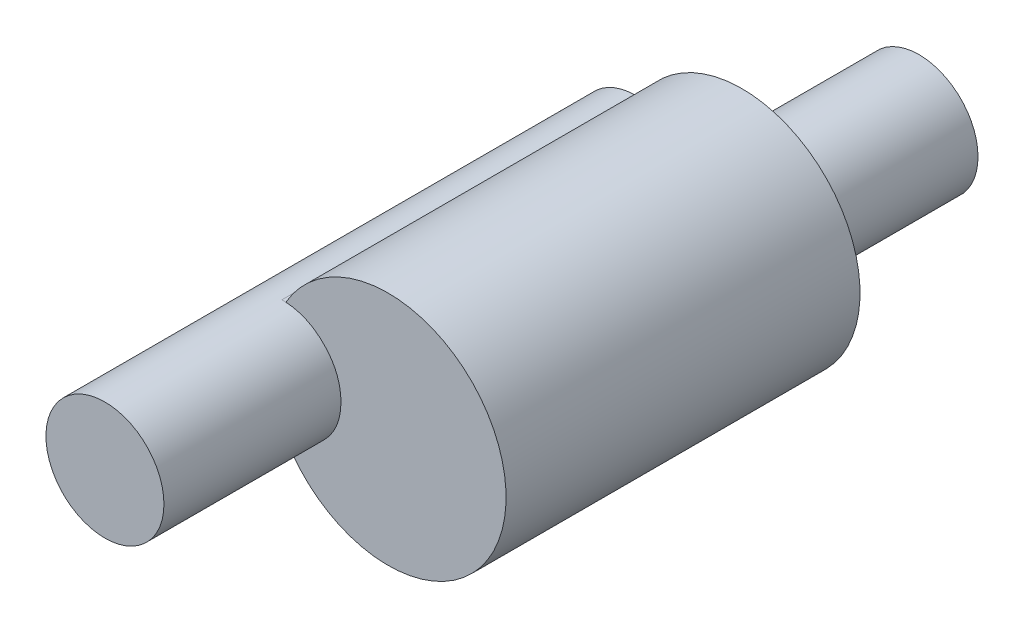
ISO-10303-21;
HEADER;
FILE_DESCRIPTION(('STEP AP214'),'2;1');
FILE_NAME('part.step','',(''),(''),'','','');
FILE_SCHEMA(('AUTOMOTIVE_DESIGN { 1 0 10303 214 1 1 1 1 }'));
ENDSEC;
DATA;
#1=APPLICATION_CONTEXT('core data for automotive mechanical design processes');
#2=APPLICATION_PROTOCOL_DEFINITION('international standard','automotive_design',2000,#1);
#3=PRODUCT_CONTEXT('',#1,'mechanical');
#4=PRODUCT('Part','Part','',(#3));
#5=PRODUCT_RELATED_PRODUCT_CATEGORY('part','',(#4));
#6=PRODUCT_DEFINITION_FORMATION('','',#4);
#7=PRODUCT_DEFINITION_CONTEXT('part definition',#1,'design');
#8=PRODUCT_DEFINITION('design','',#6,#7);
#9=PRODUCT_DEFINITION_SHAPE('','',#8);
#10=(LENGTH_UNIT() NAMED_UNIT(*) SI_UNIT(.MILLI.,.METRE.));
#11=(NAMED_UNIT(*) PLANE_ANGLE_UNIT() SI_UNIT($,.RADIAN.));
#12=(NAMED_UNIT(*) SI_UNIT($,.STERADIAN.) SOLID_ANGLE_UNIT());
#13=UNCERTAINTY_MEASURE_WITH_UNIT(LENGTH_MEASURE(1.E-05),#10,'distance_accuracy_value','');
#14=(GEOMETRIC_REPRESENTATION_CONTEXT(3) GLOBAL_UNCERTAINTY_ASSIGNED_CONTEXT((#13)) GLOBAL_UNIT_ASSIGNED_CONTEXT((#10,
#11,#12)) REPRESENTATION_CONTEXT('',''));
#15=CARTESIAN_POINT('',(0.,0.,0.));
#16=DIRECTION('',(0.,0.,1.));
#17=DIRECTION('',(1.,0.,0.));
#18=AXIS2_PLACEMENT_3D('',#15,#16,#17);
#19=CARTESIAN_POINT('',(0.,0.,6.));
#20=DIRECTION('',(0.,0.,1.));
#21=DIRECTION('',(1.,0.,0.));
#22=AXIS2_PLACEMENT_3D('',#19,#20,#21);
#23=PLANE('',#22);
#24=CARTESIAN_POINT('',(-5.0342280444126,7.84788835253992,6.));
#25=DIRECTION('',(0.,0.,1.));
#26=DIRECTION('',(1.,0.,0.));
#27=AXIS2_PLACEMENT_3D('',#24,#25,#26);
#28=CIRCLE('',#27,2.);
#29=CARTESIAN_POINT('',(-6.76669245303655,6.84926427653196,6.));
#30=VERTEX_POINT('',#29);
#31=CARTESIAN_POINT('',(-6.76668714164598,8.84652514541376,6.));
#32=VERTEX_POINT('',#31);
#33=EDGE_CURVE('E138',#30,#32,#28,.T.);
#34=ORIENTED_EDGE('',*,*,#33,.T.);
#35=CARTESIAN_POINT('',(-6.76738222517027,8.84597482446596,6.));
#36=CARTESIAN_POINT('',(-6.38022656406492,8.82324285618813,6.));
#37=CARTESIAN_POINT('',(-6.1037814899028,8.53100447027773,6.));
#38=CARTESIAN_POINT('',(-5.8346134377234,8.24645884273863,6.));
#39=CARTESIAN_POINT('',(-5.83422810776621,7.84827402231375,6.));
#40=CARTESIAN_POINT('',(-5.83384473358747,7.45211022641057,6.));
#41=CARTESIAN_POINT('',(-6.10325902454189,7.16539571486305,6.));
#42=CARTESIAN_POINT('',(-6.37757305535676,6.87346683062646,6.));
#43=CARTESIAN_POINT('',(-6.76640371085783,6.84994053177037,6.));
#44=B_SPLINE_CURVE_WITH_KNOTS('',2,(#35,#36,#37,#38,#39,#40,#41,#42,#43),.UNSPECIFIED.,.F.,.F.,
(3,2,2,2,3),(0.,0.25,0.5,0.75,1.),.UNSPECIFIED.);
#45=EDGE_CURVE('E69',#32,#30,#44,.T.);
#46=ORIENTED_EDGE('',*,*,#45,.T.);
#47=EDGE_LOOP('',(#34,#46));
#48=FACE_BOUND('',#47,.T.);
#49=ADVANCED_FACE('F59',(#48),#23,.T.);
#50=CARTESIAN_POINT('',(0.,8.84788835253992,6.));
#51=DIRECTION('',(0.,1.,0.));
#52=DIRECTION('',(0.,0.,1.));
#53=AXIS2_PLACEMENT_3D('',#50,#51,#52);
#54=PLANE('',#53);
#55=DIRECTION('',(1.,0.,0.));
#56=VECTOR('',#55,1.);
#57=CARTESIAN_POINT('',(0.,8.84788835253992,0.));
#58=LINE('',#57,#56);
#59=CARTESIAN_POINT('',(-6.8342280444126,8.84788835253992,0.));
#60=VERTEX_POINT('',#59);
#61=CARTESIAN_POINT('',(-6.76627885198148,8.84788835253992,0.));
#62=VERTEX_POINT('',#61);
#63=EDGE_CURVE('E112',#60,#62,#58,.T.);
#64=ORIENTED_EDGE('',*,*,#63,.F.);
#65=DIRECTION('',(0.,0.,-1.));
#66=VECTOR('',#65,1.);
#67=CARTESIAN_POINT('',(-6.8342280444126,8.84788835253992,6.));
#68=LINE('',#67,#66);
#69=CARTESIAN_POINT('',(-6.8342280444126,8.84788835253992,6.));
#70=VERTEX_POINT('',#69);
#71=EDGE_CURVE('E93',#70,#60,#68,.T.);
#72=ORIENTED_EDGE('',*,*,#71,.F.);
#73=CARTESIAN_POINT('',(-6.8342280444126,8.84788835253992,6.));
#74=DIRECTION('',(1.,0.,0.));
#75=VECTOR('',#74,1.);
#76=LINE('',#73,#75);
#77=EDGE_CURVE('E101',#70,#32,#76,.T.);
#78=ORIENTED_EDGE('',*,*,#77,.T.);
#79=DIRECTION('',(0.,0.,-1.));
#80=VECTOR('',#79,1.);
#81=CARTESIAN_POINT('',(-6.76627885198148,8.84788835253992,6.));
#82=LINE('',#81,#80);
#83=EDGE_CURVE('E105',#32,#62,#82,.T.);
#84=ORIENTED_EDGE('',*,*,#83,.T.);
#85=EDGE_LOOP('',(#64,#72,#78,#84));
#86=FACE_BOUND('',#85,.T.);
#87=ADVANCED_FACE('F116',(#86),#54,.T.);
#88=CARTESIAN_POINT('',(0.,0.,0.));
#89=DIRECTION('',(0.,0.,1.));
#90=DIRECTION('',(1.,0.,0.));
#91=AXIS2_PLACEMENT_3D('',#88,#89,#90);
#92=PLANE('',#91);
#93=CARTESIAN_POINT('',(-5.0342280444126,7.84788835253992,0.));
#94=DIRECTION('',(0.,0.,1.));
#95=DIRECTION('',(1.,0.,0.));
#96=AXIS2_PLACEMENT_3D('',#93,#94,#95);
#97=CIRCLE('',#96,1.);
#98=CARTESIAN_POINT('',(-4.0342280444126,7.84788835253992,0.));
#99=VERTEX_POINT('',#98);
#100=EDGE_CURVE('E12',#99,#99,#97,.F.);
#101=ORIENTED_EDGE('',*,*,#100,.F.);
#102=EDGE_LOOP('',(#101));
#103=FACE_BOUND('',#102,.T.);
#104=DIRECTION('',(1.,0.,0.));
#105=VECTOR('',#104,1.);
#106=CARTESIAN_POINT('',(0.,6.84788835253992,0.));
#107=LINE('',#106,#105);
#108=CARTESIAN_POINT('',(-6.8342280444126,6.84788835253992,0.));
#109=VERTEX_POINT('',#108);
#110=CARTESIAN_POINT('',(-6.76627885198148,6.84788835253992,0.));
#111=VERTEX_POINT('',#110);
#112=EDGE_CURVE('E114',#109,#111,#107,.T.);
#113=ORIENTED_EDGE('',*,*,#112,.F.);
#114=CARTESIAN_POINT('',(-6.8342280444126,7.84788835253992,0.));
#115=DIRECTION('',(0.,0.,1.));
#116=DIRECTION('',(1.,0.,0.));
#117=AXIS2_PLACEMENT_3D('',#114,#115,#116);
#118=CIRCLE('',#117,1.);
#119=EDGE_CURVE('E97',#60,#109,#118,.T.);
#120=ORIENTED_EDGE('',*,*,#119,.F.);
#121=ORIENTED_EDGE('',*,*,#63,.T.);
#122=CARTESIAN_POINT('',(-5.0342280444126,7.84788835253992,0.));
#123=DIRECTION('',(0.,0.,1.));
#124=DIRECTION('',(1.,0.,0.));
#125=AXIS2_PLACEMENT_3D('',#122,#123,#124);
#126=CIRCLE('',#125,2.);
#127=EDGE_CURVE('E119',#111,#62,#126,.T.);
#128=ORIENTED_EDGE('',*,*,#127,.F.);
#129=EDGE_LOOP('',(#113,#120,#121,#128));
#130=FACE_BOUND('',#129,.T.);
#131=ADVANCED_FACE('F111',(#103,#130),#92,.F.);
#132=CARTESIAN_POINT('',(-5.0342280444126,7.84788835253992,6.));
#133=DIRECTION('',(0.,0.,-1.));
#134=DIRECTION('',(-1.,0.,0.));
#135=AXIS2_PLACEMENT_3D('',#132,#133,#134);
#136=CYLINDRICAL_SURFACE('',#135,2.);
#137=ORIENTED_EDGE('',*,*,#127,.T.);
#138=ORIENTED_EDGE('',*,*,#83,.F.);
#139=ORIENTED_EDGE('',*,*,#33,.F.);
#140=DIRECTION('',(0.,0.,-1.));
#141=VECTOR('',#140,1.);
#142=CARTESIAN_POINT('',(-6.76627885198148,6.84788835253992,6.));
#143=LINE('',#142,#141);
#144=EDGE_CURVE('E143',#30,#111,#143,.T.);
#145=ORIENTED_EDGE('',*,*,#144,.T.);
#146=EDGE_LOOP('',(#137,#138,#139,#145));
#147=FACE_BOUND('',#146,.T.);
#148=ADVANCED_FACE('F162',(#147),#136,.T.);
#149=CARTESIAN_POINT('',(0.,6.84788835253992,6.));
#150=DIRECTION('',(0.,1.,0.));
#151=DIRECTION('',(0.,0.,1.));
#152=AXIS2_PLACEMENT_3D('',#149,#150,#151);
#153=PLANE('',#152);
#154=ORIENTED_EDGE('',*,*,#112,.T.);
#155=ORIENTED_EDGE('',*,*,#144,.F.);
#156=CARTESIAN_POINT('',(-6.8342280444126,7.84788835253992,6.));
#157=DIRECTION('',(0.,0.,1.));
#158=DIRECTION('',(0.,-1.,0.));
#159=AXIS2_PLACEMENT_3D('',#156,#157,#158);
#160=CIRCLE('',#159,1.);
#161=CARTESIAN_POINT('',(-6.8342280444126,6.84788835253992,6.));
#162=VERTEX_POINT('',#161);
#163=EDGE_CURVE('E76',#162,#30,#160,.T.);
#164=ORIENTED_EDGE('',*,*,#163,.F.);
#165=DIRECTION('',(0.,0.,-1.));
#166=VECTOR('',#165,1.);
#167=CARTESIAN_POINT('',(-6.8342280444126,6.84788835253992,6.));
#168=LINE('',#167,#166);
#169=EDGE_CURVE('E106',#162,#109,#168,.T.);
#170=ORIENTED_EDGE('',*,*,#169,.T.);
#171=EDGE_LOOP('',(#154,#155,#164,#170));
#172=FACE_BOUND('',#171,.T.);
#173=ADVANCED_FACE('F61',(#172),#153,.F.);
#174=CARTESIAN_POINT('',(-6.8342280444126,7.84788835253992,6.));
#175=DIRECTION('',(0.,0.,-1.));
#176=DIRECTION('',(-1.,0.,0.));
#177=AXIS2_PLACEMENT_3D('',#174,#175,#176);
#178=CYLINDRICAL_SURFACE('',#177,1.);
#179=ORIENTED_EDGE('',*,*,#119,.T.);
#180=ORIENTED_EDGE('',*,*,#169,.F.);
#181=ORIENTED_EDGE('',*,*,#163,.T.);
#182=ORIENTED_EDGE('',*,*,#45,.F.);
#183=ORIENTED_EDGE('',*,*,#77,.F.);
#184=ORIENTED_EDGE('',*,*,#71,.T.);
#185=EDGE_LOOP('',(#179,#180,#181,#182,#183,#184));
#186=FACE_BOUND('',#185,.T.);
#187=CARTESIAN_POINT('',(-6.8342280444126,7.84788835253992,9.));
#188=DIRECTION('',(0.,0.,1.));
#189=DIRECTION('',(1.,0.,0.));
#190=AXIS2_PLACEMENT_3D('',#187,#188,#189);
#191=CIRCLE('',#190,1.);
#192=CARTESIAN_POINT('',(-5.8342280444126,7.84788835253992,9.));
#193=VERTEX_POINT('',#192);
#194=EDGE_CURVE('E220',#193,#193,#191,.T.);
#195=ORIENTED_EDGE('',*,*,#194,.F.);
#196=EDGE_LOOP('',(#195));
#197=FACE_BOUND('',#196,.T.);
#198=ADVANCED_FACE('F95',(#186,#197),#178,.T.);
#199=CARTESIAN_POINT('',(-6.8342280444126,7.84788835253992,9.));
#200=DIRECTION('',(0.,0.,1.));
#201=DIRECTION('',(1.,0.,0.));
#202=AXIS2_PLACEMENT_3D('',#199,#200,#201);
#203=PLANE('',#202);
#204=ORIENTED_EDGE('',*,*,#194,.T.);
#205=EDGE_LOOP('',(#204));
#206=FACE_BOUND('',#205,.T.);
#207=ADVANCED_FACE('F179',(#206),#203,.T.);
#208=CARTESIAN_POINT('',(-5.0342280444126,7.84788835253992,-3.));
#209=DIRECTION('',(0.,0.,1.));
#210=DIRECTION('',(1.,0.,0.));
#211=AXIS2_PLACEMENT_3D('',#208,#209,#210);
#212=CYLINDRICAL_SURFACE('',#211,1.);
#213=CARTESIAN_POINT('',(-5.0342280444126,7.84788835253992,-3.));
#214=DIRECTION('',(0.,0.,-1.));
#215=DIRECTION('',(-1.,0.,0.));
#216=AXIS2_PLACEMENT_3D('',#213,#214,#215);
#217=CIRCLE('',#216,1.);
#218=CARTESIAN_POINT('',(-6.0342280444126,7.84788835253992,-3.));
#219=VERTEX_POINT('',#218);
#220=EDGE_CURVE('E222',#219,#219,#217,.T.);
#221=ORIENTED_EDGE('',*,*,#220,.F.);
#222=EDGE_LOOP('',(#221));
#223=FACE_BOUND('',#222,.T.);
#224=ORIENTED_EDGE('',*,*,#100,.T.);
#225=EDGE_LOOP('',(#224));
#226=FACE_BOUND('',#225,.T.);
#227=ADVANCED_FACE('F230',(#223,#226),#212,.T.);
#228=CARTESIAN_POINT('',(-5.0342280444126,7.84788835253992,-3.));
#229=DIRECTION('',(0.,0.,-1.));
#230=DIRECTION('',(-1.,0.,0.));
#231=AXIS2_PLACEMENT_3D('',#228,#229,#230);
#232=PLANE('',#231);
#233=ORIENTED_EDGE('',*,*,#220,.T.);
#234=EDGE_LOOP('',(#233));
#235=FACE_BOUND('',#234,.T.);
#236=ADVANCED_FACE('F228',(#235),#232,.T.);
#237=CLOSED_SHELL('',(#49,#87,#131,#148,#173,#198,#207,#227,#236));
#238=MANIFOLD_SOLID_BREP('B2',#237);
#239=ADVANCED_BREP_SHAPE_REPRESENTATION('',(#18,#238),#14);
#240=SHAPE_DEFINITION_REPRESENTATION(#9,#239);
ENDSEC;
END-ISO-10303-21;
